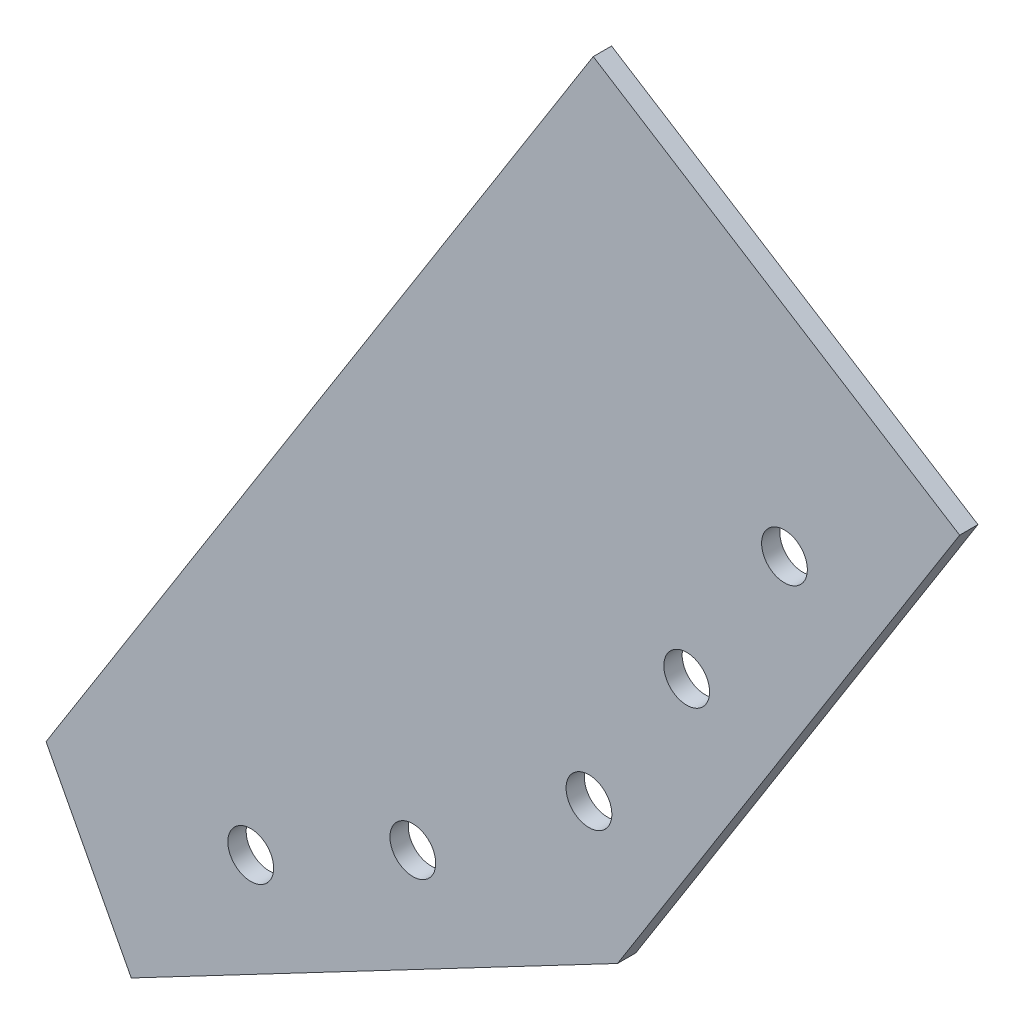
ISO-10303-21;
HEADER;
FILE_DESCRIPTION(('STEP AP214'),'2;1');
FILE_NAME('part.step','',(''),(''),'','','');
FILE_SCHEMA(('AUTOMOTIVE_DESIGN { 1 0 10303 214 1 1 1 1 }'));
ENDSEC;
DATA;
#1=APPLICATION_CONTEXT('core data for automotive mechanical design processes');
#2=APPLICATION_PROTOCOL_DEFINITION('international standard','automotive_design',2000,#1);
#3=PRODUCT_CONTEXT('',#1,'mechanical');
#4=PRODUCT('Part','Part','',(#3));
#5=PRODUCT_RELATED_PRODUCT_CATEGORY('part','',(#4));
#6=PRODUCT_DEFINITION_FORMATION('','',#4);
#7=PRODUCT_DEFINITION_CONTEXT('part definition',#1,'design');
#8=PRODUCT_DEFINITION('design','',#6,#7);
#9=PRODUCT_DEFINITION_SHAPE('','',#8);
#10=(LENGTH_UNIT() NAMED_UNIT(*) SI_UNIT(.MILLI.,.METRE.));
#11=(NAMED_UNIT(*) PLANE_ANGLE_UNIT() SI_UNIT($,.RADIAN.));
#12=(NAMED_UNIT(*) SI_UNIT($,.STERADIAN.) SOLID_ANGLE_UNIT());
#13=UNCERTAINTY_MEASURE_WITH_UNIT(LENGTH_MEASURE(1.E-05),#10,'distance_accuracy_value','');
#14=(GEOMETRIC_REPRESENTATION_CONTEXT(3) GLOBAL_UNCERTAINTY_ASSIGNED_CONTEXT((#13)) GLOBAL_UNIT_ASSIGNED_CONTEXT((#10,
#11,#12)) REPRESENTATION_CONTEXT('',''));
#15=CARTESIAN_POINT('',(0.,0.,0.));
#16=DIRECTION('',(0.,0.,1.));
#17=DIRECTION('',(1.,0.,0.));
#18=AXIS2_PLACEMENT_3D('',#15,#16,#17);
#19=CARTESIAN_POINT('',(-51.9718568575239,-28.6415128143543,2.));
#20=DIRECTION('',(0.845622391535878,-0.533781576052548,0.));
#21=DIRECTION('',(0.533781576052548,0.845622391535878,0.));
#22=AXIS2_PLACEMENT_3D('',#19,#20,#21);
#23=PLANE('',#22);
#24=DIRECTION('',(-0.533781576052548,-0.845622391535878,0.));
#25=VECTOR('',#24,1.);
#26=CARTESIAN_POINT('',(-51.9718568575239,-28.6415128143543,0.));
#27=LINE('',#26,#25);
#28=CARTESIAN_POINT('',(7.79114200164505,66.0356590625397,0.));
#29=VERTEX_POINT('',#28);
#30=CARTESIAN_POINT('',(-51.9718568575239,-28.6415128143543,0.));
#31=VERTEX_POINT('',#30);
#32=EDGE_CURVE('E110',#29,#31,#27,.T.);
#33=ORIENTED_EDGE('',*,*,#32,.T.);
#34=DIRECTION('',(0.,0.,-1.));
#35=VECTOR('',#34,1.);
#36=CARTESIAN_POINT('',(-51.9718568575239,-28.6415128143543,2.));
#37=LINE('',#36,#35);
#38=CARTESIAN_POINT('',(-51.9718568575239,-28.6415128143543,2.));
#39=VERTEX_POINT('',#38);
#40=EDGE_CURVE('E11',#39,#31,#37,.T.);
#41=ORIENTED_EDGE('',*,*,#40,.F.);
#42=DIRECTION('',(-0.533781576052548,-0.845622391535878,0.));
#43=VECTOR('',#42,1.);
#44=CARTESIAN_POINT('',(-51.9718568575239,-28.6415128143543,2.));
#45=LINE('',#44,#43);
#46=CARTESIAN_POINT('',(7.79114200164505,66.0356590625397,2.));
#47=VERTEX_POINT('',#46);
#48=EDGE_CURVE('E119',#47,#39,#45,.T.);
#49=ORIENTED_EDGE('',*,*,#48,.F.);
#50=DIRECTION('',(0.,0.,-1.));
#51=VECTOR('',#50,1.);
#52=CARTESIAN_POINT('',(7.79114200164505,66.0356590625397,2.));
#53=LINE('',#52,#51);
#54=EDGE_CURVE('E106',#47,#29,#53,.T.);
#55=ORIENTED_EDGE('',*,*,#54,.T.);
#56=EDGE_LOOP('',(#33,#41,#49,#55));
#57=FACE_BOUND('',#56,.T.);
#58=ADVANCED_FACE('F34',(#57),#23,.F.);
#59=CARTESIAN_POINT('',(-42.663063156469,-46.3431048283851,2.));
#60=DIRECTION('',(0.885079600701542,0.465439685052747,0.));
#61=DIRECTION('',(-0.465439685052747,0.885079600701542,0.));
#62=AXIS2_PLACEMENT_3D('',#59,#60,#61);
#63=PLANE('',#62);
#64=DIRECTION('',(0.465439685052747,-0.885079600701542,0.));
#65=VECTOR('',#64,1.);
#66=CARTESIAN_POINT('',(-42.663063156469,-46.3431048283851,0.));
#67=LINE('',#66,#65);
#68=CARTESIAN_POINT('',(-42.663063156469,-46.3431048283851,0.));
#69=VERTEX_POINT('',#68);
#70=EDGE_CURVE('E113',#31,#69,#67,.T.);
#71=ORIENTED_EDGE('',*,*,#70,.T.);
#72=DIRECTION('',(0.,0.,-1.));
#73=VECTOR('',#72,1.);
#74=CARTESIAN_POINT('',(-42.663063156469,-46.3431048283851,2.));
#75=LINE('',#74,#73);
#76=CARTESIAN_POINT('',(-42.663063156469,-46.3431048283851,2.));
#77=VERTEX_POINT('',#76);
#78=EDGE_CURVE('E43',#77,#69,#75,.T.);
#79=ORIENTED_EDGE('',*,*,#78,.F.);
#80=DIRECTION('',(0.465439685052747,-0.885079600701542,0.));
#81=VECTOR('',#80,1.);
#82=CARTESIAN_POINT('',(-42.663063156469,-46.3431048283851,2.));
#83=LINE('',#82,#81);
#84=EDGE_CURVE('E86',#39,#77,#83,.T.);
#85=ORIENTED_EDGE('',*,*,#84,.F.);
#86=ORIENTED_EDGE('',*,*,#40,.T.);
#87=EDGE_LOOP('',(#71,#79,#85,#86));
#88=FACE_BOUND('',#87,.T.);
#89=ADVANCED_FACE('F156',(#88),#63,.F.);
#90=CARTESIAN_POINT('',(10.4417128856235,-18.4167237252203,2.));
#91=DIRECTION('',(-0.465439685052747,0.885079600701541,0.));
#92=DIRECTION('',(-0.885079600701541,-0.465439685052747,0.));
#93=AXIS2_PLACEMENT_3D('',#90,#91,#92);
#94=PLANE('',#93);
#95=DIRECTION('',(0.885079600701541,0.465439685052747,0.));
#96=VECTOR('',#95,1.);
#97=CARTESIAN_POINT('',(10.4417128856235,-18.4167237252203,0.));
#98=LINE('',#97,#96);
#99=CARTESIAN_POINT('',(10.4417128856235,-18.4167237252203,0.));
#100=VERTEX_POINT('',#99);
#101=EDGE_CURVE('E101',#69,#100,#98,.T.);
#102=ORIENTED_EDGE('',*,*,#101,.T.);
#103=DIRECTION('',(0.,0.,-1.));
#104=VECTOR('',#103,1.);
#105=CARTESIAN_POINT('',(10.4417128856235,-18.4167237252203,2.));
#106=LINE('',#105,#104);
#107=CARTESIAN_POINT('',(10.4417128856235,-18.4167237252203,2.));
#108=VERTEX_POINT('',#107);
#109=EDGE_CURVE('E98',#108,#100,#106,.T.);
#110=ORIENTED_EDGE('',*,*,#109,.F.);
#111=DIRECTION('',(0.885079600701541,0.465439685052747,0.));
#112=VECTOR('',#111,1.);
#113=CARTESIAN_POINT('',(10.4417128856235,-18.4167237252203,2.));
#114=LINE('',#113,#112);
#115=EDGE_CURVE('E90',#77,#108,#114,.T.);
#116=ORIENTED_EDGE('',*,*,#115,.F.);
#117=ORIENTED_EDGE('',*,*,#78,.T.);
#118=EDGE_LOOP('',(#102,#110,#116,#117));
#119=FACE_BOUND('',#118,.T.);
#120=ADVANCED_FACE('F99',(#119),#94,.F.);
#121=CARTESIAN_POINT('',(47.8064232093018,40.7768436822912,2.));
#122=DIRECTION('',(-0.845622391535879,0.533781576052548,0.));
#123=DIRECTION('',(-0.533781576052548,-0.845622391535878,0.));
#124=AXIS2_PLACEMENT_3D('',#121,#122,#123);
#125=PLANE('',#124);
#126=DIRECTION('',(0.533781576052547,0.845622391535878,0.));
#127=VECTOR('',#126,1.);
#128=CARTESIAN_POINT('',(47.8064232093018,40.7768436822912,0.));
#129=LINE('',#128,#127);
#130=CARTESIAN_POINT('',(47.8064232093018,40.7768436822912,0.));
#131=VERTEX_POINT('',#130);
#132=EDGE_CURVE('E72',#100,#131,#129,.T.);
#133=ORIENTED_EDGE('',*,*,#132,.T.);
#134=DIRECTION('',(0.,0.,-1.));
#135=VECTOR('',#134,1.);
#136=CARTESIAN_POINT('',(47.8064232093018,40.7768436822912,2.));
#137=LINE('',#136,#135);
#138=CARTESIAN_POINT('',(47.8064232093018,40.7768436822912,2.));
#139=VERTEX_POINT('',#138);
#140=EDGE_CURVE('E102',#139,#131,#137,.T.);
#141=ORIENTED_EDGE('',*,*,#140,.F.);
#142=DIRECTION('',(0.533781576052547,0.845622391535878,0.));
#143=VECTOR('',#142,1.);
#144=CARTESIAN_POINT('',(47.8064232093018,40.7768436822912,2.));
#145=LINE('',#144,#143);
#146=EDGE_CURVE('E94',#108,#139,#145,.T.);
#147=ORIENTED_EDGE('',*,*,#146,.F.);
#148=ORIENTED_EDGE('',*,*,#109,.T.);
#149=EDGE_LOOP('',(#133,#141,#147,#148));
#150=FACE_BOUND('',#149,.T.);
#151=ADVANCED_FACE('F104',(#150),#125,.F.);
#152=CARTESIAN_POINT('',(47.8064232093018,40.7768436822912,2.));
#153=DIRECTION('',(-0.533781576052548,-0.845622391535878,0.));
#154=DIRECTION('',(0.845622391535878,-0.533781576052548,0.));
#155=AXIS2_PLACEMENT_3D('',#152,#153,#154);
#156=PLANE('',#155);
#157=DIRECTION('',(-0.845622391535878,0.533781576052548,0.));
#158=VECTOR('',#157,1.);
#159=CARTESIAN_POINT('',(47.8064232093018,40.7768436822912,0.));
#160=LINE('',#159,#158);
#161=EDGE_CURVE('E78',#131,#29,#160,.T.);
#162=ORIENTED_EDGE('',*,*,#161,.T.);
#163=ORIENTED_EDGE('',*,*,#54,.F.);
#164=DIRECTION('',(-0.845622391535878,0.533781576052548,0.));
#165=VECTOR('',#164,1.);
#166=CARTESIAN_POINT('',(47.8064232093018,40.7768436822912,2.));
#167=LINE('',#166,#165);
#168=EDGE_CURVE('E52',#139,#47,#167,.T.);
#169=ORIENTED_EDGE('',*,*,#168,.F.);
#170=ORIENTED_EDGE('',*,*,#140,.T.);
#171=EDGE_LOOP('',(#162,#163,#169,#170));
#172=FACE_BOUND('',#171,.T.);
#173=ADVANCED_FACE('F170',(#172),#156,.F.);
#174=CARTESIAN_POINT('',(0.,0.,2.));
#175=DIRECTION('',(0.,0.,1.));
#176=DIRECTION('',(1.,0.,0.));
#177=AXIS2_PLACEMENT_3D('',#174,#175,#176);
#178=PLANE('',#177);
#179=CARTESIAN_POINT('',(28.6745677728921,29.2022116120991,2.));
#180=DIRECTION('',(0.,0.,1.));
#181=DIRECTION('',(1.,0.,0.));
#182=AXIS2_PLACEMENT_3D('',#179,#180,#181);
#183=CIRCLE('',#182,2.5);
#184=CARTESIAN_POINT('',(31.1745677728921,29.2022116120991,2.));
#185=VERTEX_POINT('',#184);
#186=EDGE_CURVE('E136',#185,#185,#183,.T.);
#187=ORIENTED_EDGE('',*,*,#186,.F.);
#188=EDGE_LOOP('',(#187));
#189=FACE_BOUND('',#188,.T.);
#190=CARTESIAN_POINT('',(17.9989362518411,12.2897637813816,2.));
#191=DIRECTION('',(0.,0.,1.));
#192=DIRECTION('',(1.,0.,0.));
#193=AXIS2_PLACEMENT_3D('',#190,#191,#192);
#194=CIRCLE('',#193,2.5);
#195=CARTESIAN_POINT('',(20.4989362518411,12.2897637813816,2.));
#196=VERTEX_POINT('',#195);
#197=EDGE_CURVE('E125',#196,#196,#194,.T.);
#198=ORIENTED_EDGE('',*,*,#197,.F.);
#199=EDGE_LOOP('',(#198));
#200=FACE_BOUND('',#199,.T.);
#201=CARTESIAN_POINT('',(7.32330473079019,-4.62268404933601,2.));
#202=DIRECTION('',(0.,0.,1.));
#203=DIRECTION('',(1.,0.,0.));
#204=AXIS2_PLACEMENT_3D('',#201,#202,#203);
#205=CIRCLE('',#204,2.5);
#206=CARTESIAN_POINT('',(9.82330473079019,-4.62268404933601,2.));
#207=VERTEX_POINT('',#206);
#208=EDGE_CURVE('E124',#207,#207,#205,.T.);
#209=ORIENTED_EDGE('',*,*,#208,.F.);
#210=EDGE_LOOP('',(#209));
#211=FACE_BOUND('',#210,.T.);
#212=CARTESIAN_POINT('',(-29.6158679929657,-28.1835151203148,2.));
#213=DIRECTION('',(0.,0.,1.));
#214=DIRECTION('',(1.,0.,0.));
#215=AXIS2_PLACEMENT_3D('',#212,#213,#214);
#216=CIRCLE('',#215,2.5);
#217=CARTESIAN_POINT('',(-27.1158679929657,-28.1835151203148,2.));
#218=VERTEX_POINT('',#217);
#219=EDGE_CURVE('E140',#218,#218,#216,.T.);
#220=ORIENTED_EDGE('',*,*,#219,.F.);
#221=EDGE_LOOP('',(#220));
#222=FACE_BOUND('',#221,.T.);
#223=CARTESIAN_POINT('',(-11.9142759789348,-18.8747214192598,2.));
#224=DIRECTION('',(0.,0.,1.));
#225=DIRECTION('',(1.,0.,0.));
#226=AXIS2_PLACEMENT_3D('',#223,#224,#225);
#227=CIRCLE('',#226,2.5);
#228=CARTESIAN_POINT('',(-9.4142759789348,-18.8747214192598,2.));
#229=VERTEX_POINT('',#228);
#230=EDGE_CURVE('E145',#229,#229,#227,.T.);
#231=ORIENTED_EDGE('',*,*,#230,.F.);
#232=EDGE_LOOP('',(#231));
#233=FACE_BOUND('',#232,.T.);
#234=ORIENTED_EDGE('',*,*,#48,.T.);
#235=ORIENTED_EDGE('',*,*,#84,.T.);
#236=ORIENTED_EDGE('',*,*,#115,.T.);
#237=ORIENTED_EDGE('',*,*,#146,.T.);
#238=ORIENTED_EDGE('',*,*,#168,.T.);
#239=EDGE_LOOP('',(#234,#235,#236,#237,#238));
#240=FACE_BOUND('',#239,.T.);
#241=ADVANCED_FACE('F92',(#189,#200,#211,#222,#233,#240),#178,.T.);
#242=CARTESIAN_POINT('',(0.,0.,0.));
#243=DIRECTION('',(0.,0.,1.));
#244=DIRECTION('',(1.,0.,0.));
#245=AXIS2_PLACEMENT_3D('',#242,#243,#244);
#246=PLANE('',#245);
#247=CARTESIAN_POINT('',(28.6745677728921,29.2022116120991,0.));
#248=DIRECTION('',(0.,0.,1.));
#249=DIRECTION('',(1.,0.,0.));
#250=AXIS2_PLACEMENT_3D('',#247,#248,#249);
#251=CIRCLE('',#250,2.5);
#252=CARTESIAN_POINT('',(31.1745677728921,29.2022116120991,0.));
#253=VERTEX_POINT('',#252);
#254=EDGE_CURVE('E37',#253,#253,#251,.T.);
#255=ORIENTED_EDGE('',*,*,#254,.T.);
#256=EDGE_LOOP('',(#255));
#257=FACE_BOUND('',#256,.T.);
#258=CARTESIAN_POINT('',(17.9989362518411,12.2897637813816,0.));
#259=DIRECTION('',(0.,0.,1.));
#260=DIRECTION('',(1.,0.,0.));
#261=AXIS2_PLACEMENT_3D('',#258,#259,#260);
#262=CIRCLE('',#261,2.5);
#263=CARTESIAN_POINT('',(20.4989362518411,12.2897637813816,0.));
#264=VERTEX_POINT('',#263);
#265=EDGE_CURVE('E122',#264,#264,#262,.T.);
#266=ORIENTED_EDGE('',*,*,#265,.T.);
#267=EDGE_LOOP('',(#266));
#268=FACE_BOUND('',#267,.T.);
#269=CARTESIAN_POINT('',(7.32330473079019,-4.62268404933601,0.));
#270=DIRECTION('',(0.,0.,1.));
#271=DIRECTION('',(1.,0.,0.));
#272=AXIS2_PLACEMENT_3D('',#269,#270,#271);
#273=CIRCLE('',#272,2.5);
#274=CARTESIAN_POINT('',(9.82330473079019,-4.62268404933601,0.));
#275=VERTEX_POINT('',#274);
#276=EDGE_CURVE('E129',#275,#275,#273,.T.);
#277=ORIENTED_EDGE('',*,*,#276,.T.);
#278=EDGE_LOOP('',(#277));
#279=FACE_BOUND('',#278,.T.);
#280=CARTESIAN_POINT('',(-29.6158679929657,-28.1835151203148,0.));
#281=DIRECTION('',(0.,0.,1.));
#282=DIRECTION('',(1.,0.,0.));
#283=AXIS2_PLACEMENT_3D('',#280,#281,#282);
#284=CIRCLE('',#283,2.5);
#285=CARTESIAN_POINT('',(-27.1158679929657,-28.1835151203148,0.));
#286=VERTEX_POINT('',#285);
#287=EDGE_CURVE('E142',#286,#286,#284,.T.);
#288=ORIENTED_EDGE('',*,*,#287,.T.);
#289=EDGE_LOOP('',(#288));
#290=FACE_BOUND('',#289,.T.);
#291=CARTESIAN_POINT('',(-11.9142759789348,-18.8747214192598,0.));
#292=DIRECTION('',(0.,0.,1.));
#293=DIRECTION('',(1.,0.,0.));
#294=AXIS2_PLACEMENT_3D('',#291,#292,#293);
#295=CIRCLE('',#294,2.5);
#296=CARTESIAN_POINT('',(-9.4142759789348,-18.8747214192598,0.));
#297=VERTEX_POINT('',#296);
#298=EDGE_CURVE('E114',#297,#297,#295,.T.);
#299=ORIENTED_EDGE('',*,*,#298,.T.);
#300=EDGE_LOOP('',(#299));
#301=FACE_BOUND('',#300,.T.);
#302=ORIENTED_EDGE('',*,*,#32,.F.);
#303=ORIENTED_EDGE('',*,*,#161,.F.);
#304=ORIENTED_EDGE('',*,*,#132,.F.);
#305=ORIENTED_EDGE('',*,*,#101,.F.);
#306=ORIENTED_EDGE('',*,*,#70,.F.);
#307=EDGE_LOOP('',(#302,#303,#304,#305,#306));
#308=FACE_BOUND('',#307,.T.);
#309=ADVANCED_FACE('F158',(#257,#268,#279,#290,#301,#308),#246,.F.);
#310=CARTESIAN_POINT('',(-11.9142759789348,-18.8747214192598,0.));
#311=DIRECTION('',(0.,0.,1.));
#312=DIRECTION('',(1.,0.,0.));
#313=AXIS2_PLACEMENT_3D('',#310,#311,#312);
#314=CYLINDRICAL_SURFACE('',#313,2.5);
#315=ORIENTED_EDGE('',*,*,#298,.F.);
#316=EDGE_LOOP('',(#315));
#317=FACE_BOUND('',#316,.T.);
#318=ORIENTED_EDGE('',*,*,#230,.T.);
#319=EDGE_LOOP('',(#318));
#320=FACE_BOUND('',#319,.T.);
#321=ADVANCED_FACE('F160',(#317,#320),#314,.F.);
#322=CARTESIAN_POINT('',(-29.6158679929657,-28.1835151203148,0.));
#323=DIRECTION('',(0.,0.,1.));
#324=DIRECTION('',(1.,0.,0.));
#325=AXIS2_PLACEMENT_3D('',#322,#323,#324);
#326=CYLINDRICAL_SURFACE('',#325,2.5);
#327=ORIENTED_EDGE('',*,*,#287,.F.);
#328=EDGE_LOOP('',(#327));
#329=FACE_BOUND('',#328,.T.);
#330=ORIENTED_EDGE('',*,*,#219,.T.);
#331=EDGE_LOOP('',(#330));
#332=FACE_BOUND('',#331,.T.);
#333=ADVANCED_FACE('F167',(#329,#332),#326,.F.);
#334=CARTESIAN_POINT('',(7.32330473079019,-4.62268404933601,0.));
#335=DIRECTION('',(0.,0.,1.));
#336=DIRECTION('',(1.,0.,0.));
#337=AXIS2_PLACEMENT_3D('',#334,#335,#336);
#338=CYLINDRICAL_SURFACE('',#337,2.5);
#339=ORIENTED_EDGE('',*,*,#276,.F.);
#340=EDGE_LOOP('',(#339));
#341=FACE_BOUND('',#340,.T.);
#342=ORIENTED_EDGE('',*,*,#208,.T.);
#343=EDGE_LOOP('',(#342));
#344=FACE_BOUND('',#343,.T.);
#345=ADVANCED_FACE('F221',(#341,#344),#338,.F.);
#346=CARTESIAN_POINT('',(17.9989362518411,12.2897637813816,-38.));
#347=DIRECTION('',(0.,0.,1.));
#348=DIRECTION('',(1.,0.,0.));
#349=AXIS2_PLACEMENT_3D('',#346,#347,#348);
#350=CYLINDRICAL_SURFACE('',#349,2.5);
#351=ORIENTED_EDGE('',*,*,#197,.T.);
#352=EDGE_LOOP('',(#351));
#353=FACE_BOUND('',#352,.T.);
#354=ORIENTED_EDGE('',*,*,#265,.F.);
#355=EDGE_LOOP('',(#354));
#356=FACE_BOUND('',#355,.T.);
#357=ADVANCED_FACE('F200',(#353,#356),#350,.F.);
#358=CARTESIAN_POINT('',(28.6745677728921,29.2022116120991,-38.));
#359=DIRECTION('',(0.,0.,1.));
#360=DIRECTION('',(1.,0.,0.));
#361=AXIS2_PLACEMENT_3D('',#358,#359,#360);
#362=CYLINDRICAL_SURFACE('',#361,2.5);
#363=ORIENTED_EDGE('',*,*,#186,.T.);
#364=EDGE_LOOP('',(#363));
#365=FACE_BOUND('',#364,.T.);
#366=ORIENTED_EDGE('',*,*,#254,.F.);
#367=EDGE_LOOP('',(#366));
#368=FACE_BOUND('',#367,.T.);
#369=ADVANCED_FACE('F210',(#365,#368),#362,.F.);
#370=CLOSED_SHELL('',(#58,#89,#120,#151,#173,#241,#309,#321,#333,#345,#357,#369));
#371=MANIFOLD_SOLID_BREP('B2',#370);
#372=ADVANCED_BREP_SHAPE_REPRESENTATION('',(#18,#371),#14);
#373=SHAPE_DEFINITION_REPRESENTATION(#9,#372);
ENDSEC;
END-ISO-10303-21;
